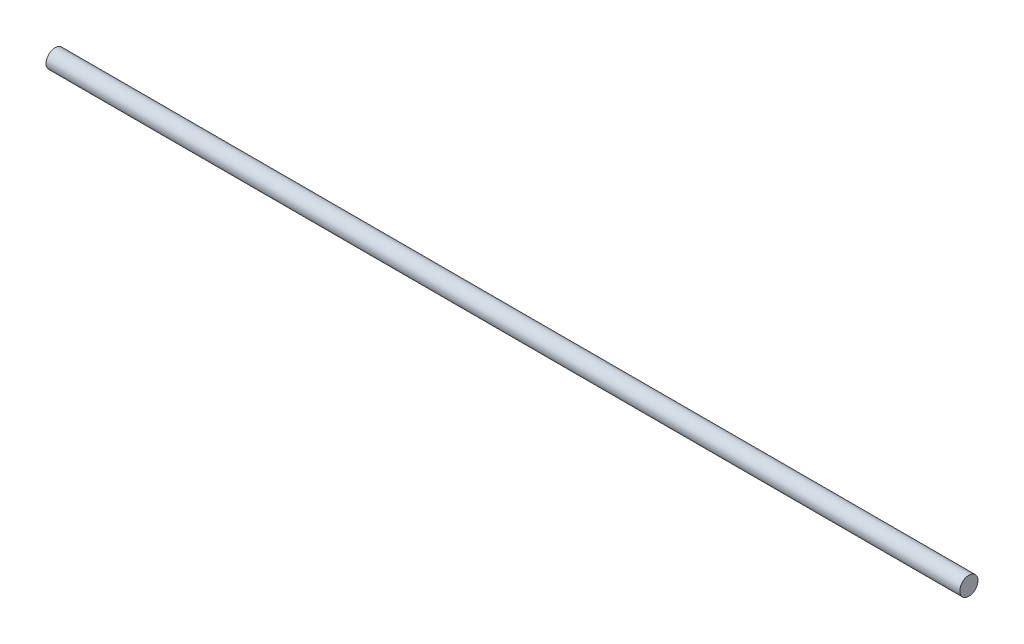
ISO-10303-21;
HEADER;
FILE_DESCRIPTION(('STEP AP214'),'2;1');
FILE_NAME('part.step','',(''),(''),'','','');
FILE_SCHEMA(('AUTOMOTIVE_DESIGN { 1 0 10303 214 1 1 1 1 }'));
ENDSEC;
DATA;
#1=APPLICATION_CONTEXT('core data for automotive mechanical design processes');
#2=APPLICATION_PROTOCOL_DEFINITION('international standard','automotive_design',2000,#1);
#3=PRODUCT_CONTEXT('',#1,'mechanical');
#4=PRODUCT('Part','Part','',(#3));
#5=PRODUCT_RELATED_PRODUCT_CATEGORY('part','',(#4));
#6=PRODUCT_DEFINITION_FORMATION('','',#4);
#7=PRODUCT_DEFINITION_CONTEXT('part definition',#1,'design');
#8=PRODUCT_DEFINITION('design','',#6,#7);
#9=PRODUCT_DEFINITION_SHAPE('','',#8);
#10=(LENGTH_UNIT() NAMED_UNIT(*) SI_UNIT(.MILLI.,.METRE.));
#11=(NAMED_UNIT(*) PLANE_ANGLE_UNIT() SI_UNIT($,.RADIAN.));
#12=(NAMED_UNIT(*) SI_UNIT($,.STERADIAN.) SOLID_ANGLE_UNIT());
#13=UNCERTAINTY_MEASURE_WITH_UNIT(LENGTH_MEASURE(1.E-05),#10,'distance_accuracy_value','');
#14=(GEOMETRIC_REPRESENTATION_CONTEXT(3) GLOBAL_UNCERTAINTY_ASSIGNED_CONTEXT((#13)) GLOBAL_UNIT_ASSIGNED_CONTEXT((#10,
#11,#12)) REPRESENTATION_CONTEXT('',''));
#15=CARTESIAN_POINT('',(0.,0.,0.));
#16=DIRECTION('',(0.,0.,1.));
#17=DIRECTION('',(1.,0.,0.));
#18=AXIS2_PLACEMENT_3D('',#15,#16,#17);
#19=CARTESIAN_POINT('',(-25.7312094596437,-4.78660565723793,0.));
#20=DIRECTION('',(-1.,0.,0.));
#21=DIRECTION('',(0.,0.,1.));
#22=AXIS2_PLACEMENT_3D('',#19,#20,#21);
#23=PLANE('',#22);
#24=CARTESIAN_POINT('',(-25.7312094596437,-4.78660565723793,0.));
#25=DIRECTION('',(-1.,0.,0.));
#26=DIRECTION('',(0.,0.,1.));
#27=AXIS2_PLACEMENT_3D('',#24,#25,#26);
#28=CIRCLE('',#27,1.5);
#29=CARTESIAN_POINT('',(-25.7312094596437,-4.78660565723793,1.5));
#30=VERTEX_POINT('',#29);
#31=EDGE_CURVE('E10',#30,#30,#28,.T.);
#32=ORIENTED_EDGE('',*,*,#31,.T.);
#33=EDGE_LOOP('',(#32));
#34=FACE_BOUND('',#33,.T.);
#35=ADVANCED_FACE('F29',(#34),#23,.T.);
#36=CARTESIAN_POINT('',(-25.7312094596437,-4.78660565723793,0.));
#37=DIRECTION('',(-1.,0.,0.));
#38=DIRECTION('',(0.,0.,1.));
#39=AXIS2_PLACEMENT_3D('',#36,#37,#38);
#40=CYLINDRICAL_SURFACE('',#39,1.5);
#41=CARTESIAN_POINT('',(124.268790540356,-4.78660565723793,0.));
#42=DIRECTION('',(-1.,0.,0.));
#43=DIRECTION('',(0.,0.,1.));
#44=AXIS2_PLACEMENT_3D('',#41,#42,#43);
#45=CIRCLE('',#44,1.5);
#46=CARTESIAN_POINT('',(124.268790540356,-4.78660565723793,1.5));
#47=VERTEX_POINT('',#46);
#48=EDGE_CURVE('E35',#47,#47,#45,.T.);
#49=ORIENTED_EDGE('',*,*,#48,.T.);
#50=EDGE_LOOP('',(#49));
#51=FACE_BOUND('',#50,.T.);
#52=ORIENTED_EDGE('',*,*,#31,.F.);
#53=EDGE_LOOP('',(#52));
#54=FACE_BOUND('',#53,.T.);
#55=ADVANCED_FACE('F41',(#51,#54),#40,.T.);
#56=CARTESIAN_POINT('',(124.268790540356,-4.78660565723793,0.));
#57=DIRECTION('',(1.,0.,0.));
#58=DIRECTION('',(0.,0.,-1.));
#59=AXIS2_PLACEMENT_3D('',#56,#57,#58);
#60=PLANE('',#59);
#61=ORIENTED_EDGE('',*,*,#48,.F.);
#62=EDGE_LOOP('',(#61));
#63=FACE_BOUND('',#62,.T.);
#64=ADVANCED_FACE('F44',(#63),#60,.T.);
#65=CLOSED_SHELL('',(#35,#55,#64));
#66=MANIFOLD_SOLID_BREP('B2',#65);
#67=ADVANCED_BREP_SHAPE_REPRESENTATION('',(#18,#66),#14);
#68=SHAPE_DEFINITION_REPRESENTATION(#9,#67);
ENDSEC;
END-ISO-10303-21;
